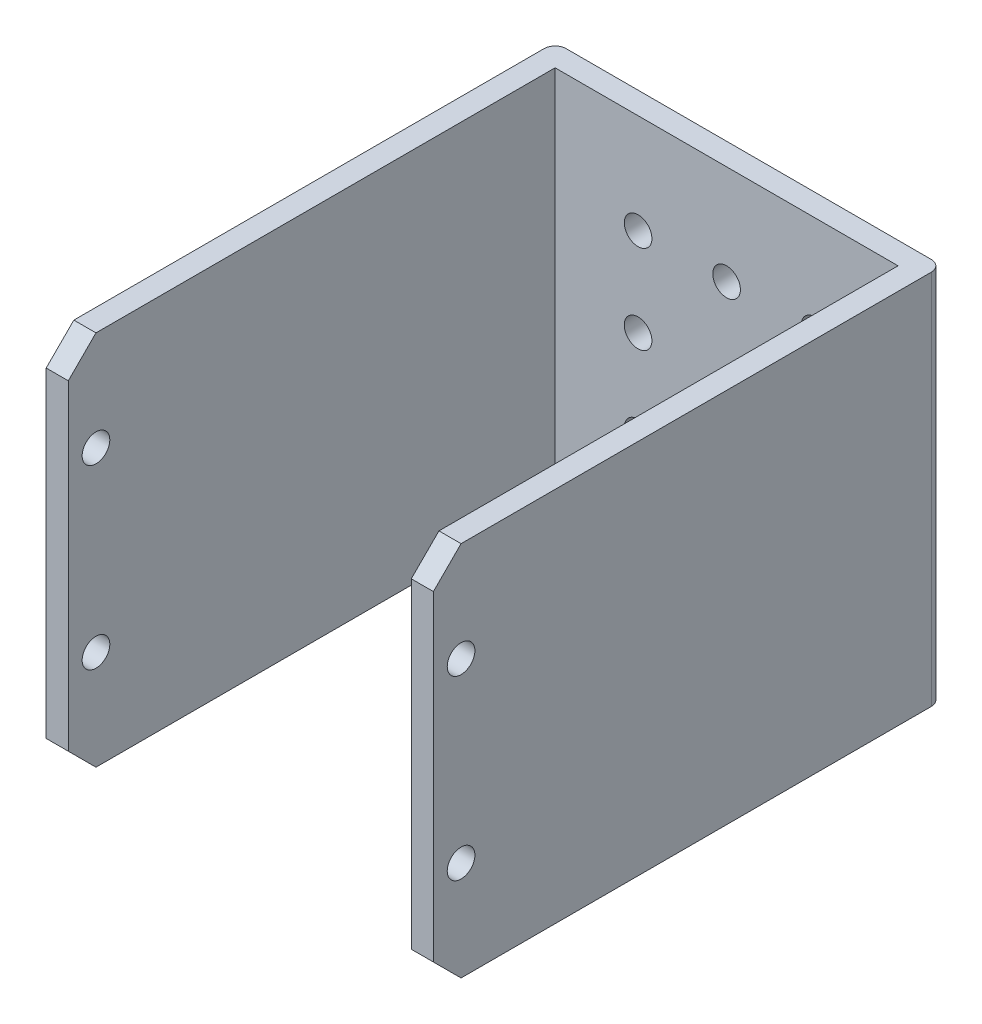
ISO-10303-21;
HEADER;
FILE_DESCRIPTION(('STEP AP214'),'2;1');
FILE_NAME('part.step','',(''),(''),'','','');
FILE_SCHEMA(('AUTOMOTIVE_DESIGN { 1 0 10303 214 1 1 1 1 }'));
ENDSEC;
DATA;
#1=APPLICATION_CONTEXT('core data for automotive mechanical design processes');
#2=APPLICATION_PROTOCOL_DEFINITION('international standard','automotive_design',2000,#1);
#3=PRODUCT_CONTEXT('',#1,'mechanical');
#4=PRODUCT('Part','Part','',(#3));
#5=PRODUCT_RELATED_PRODUCT_CATEGORY('part','',(#4));
#6=PRODUCT_DEFINITION_FORMATION('','',#4);
#7=PRODUCT_DEFINITION_CONTEXT('part definition',#1,'design');
#8=PRODUCT_DEFINITION('design','',#6,#7);
#9=PRODUCT_DEFINITION_SHAPE('','',#8);
#10=(LENGTH_UNIT() NAMED_UNIT(*) SI_UNIT(.MILLI.,.METRE.));
#11=(NAMED_UNIT(*) PLANE_ANGLE_UNIT() SI_UNIT($,.RADIAN.));
#12=(NAMED_UNIT(*) SI_UNIT($,.STERADIAN.) SOLID_ANGLE_UNIT());
#13=UNCERTAINTY_MEASURE_WITH_UNIT(LENGTH_MEASURE(1.E-05),#10,'distance_accuracy_value','');
#14=(GEOMETRIC_REPRESENTATION_CONTEXT(3) GLOBAL_UNCERTAINTY_ASSIGNED_CONTEXT((#13)) GLOBAL_UNIT_ASSIGNED_CONTEXT((#10,
#11,#12)) REPRESENTATION_CONTEXT('',''));
#15=CARTESIAN_POINT('',(0.,0.,0.));
#16=DIRECTION('',(0.,0.,1.));
#17=DIRECTION('',(1.,0.,0.));
#18=AXIS2_PLACEMENT_3D('',#15,#16,#17);
#19=CARTESIAN_POINT('',(0.,0.,46.));
#20=DIRECTION('',(0.,0.,1.));
#21=DIRECTION('',(1.,0.,0.));
#22=AXIS2_PLACEMENT_3D('',#19,#20,#21);
#23=PLANE('',#22);
#24=DIRECTION('',(0.,-1.,0.));
#25=VECTOR('',#24,1.);
#26=CARTESIAN_POINT('',(0.,0.,46.));
#27=LINE('',#26,#25);
#28=CARTESIAN_POINT('',(0.,31.5,46.));
#29=VERTEX_POINT('',#28);
#30=CARTESIAN_POINT('',(0.,2.50000000000001,46.));
#31=VERTEX_POINT('',#30);
#32=EDGE_CURVE('E182',#29,#31,#27,.T.);
#33=ORIENTED_EDGE('',*,*,#32,.T.);
#34=DIRECTION('',(1.,0.,0.));
#35=VECTOR('',#34,1.);
#36=CARTESIAN_POINT('',(2.,2.50000000000001,46.));
#37=LINE('',#36,#35);
#38=CARTESIAN_POINT('',(2.,2.50000000000001,46.));
#39=VERTEX_POINT('',#38);
#40=EDGE_CURVE('E239',#31,#39,#37,.T.);
#41=ORIENTED_EDGE('',*,*,#40,.T.);
#42=DIRECTION('',(0.,-1.,0.));
#43=VECTOR('',#42,1.);
#44=CARTESIAN_POINT('',(1.99999999999999,34.,46.));
#45=LINE('',#44,#43);
#46=CARTESIAN_POINT('',(1.99999999999999,31.5,46.));
#47=VERTEX_POINT('',#46);
#48=EDGE_CURVE('E167',#47,#39,#45,.T.);
#49=ORIENTED_EDGE('',*,*,#48,.F.);
#50=DIRECTION('',(-1.,0.,0.));
#51=VECTOR('',#50,1.);
#52=CARTESIAN_POINT('',(0.,31.5,46.));
#53=LINE('',#52,#51);
#54=EDGE_CURVE('E236',#47,#29,#53,.T.);
#55=ORIENTED_EDGE('',*,*,#54,.T.);
#56=EDGE_LOOP('',(#33,#41,#49,#55));
#57=FACE_BOUND('',#56,.T.);
#58=ADVANCED_FACE('F35',(#57),#23,.T.);
#59=CARTESIAN_POINT('',(35.,0.,46.));
#60=DIRECTION('',(-1.,0.,0.));
#61=DIRECTION('',(0.,0.,1.));
#62=AXIS2_PLACEMENT_3D('',#59,#60,#61);
#63=PLANE('',#62);
#64=CARTESIAN_POINT('',(35.,25.,43.5));
#65=DIRECTION('',(-1.,0.,0.));
#66=DIRECTION('',(0.,0.,1.));
#67=AXIS2_PLACEMENT_3D('',#64,#65,#66);
#68=CIRCLE('',#67,1.25);
#69=CARTESIAN_POINT('',(35.,25.,44.75));
#70=VERTEX_POINT('',#69);
#71=EDGE_CURVE('E169',#70,#70,#68,.T.);
#72=ORIENTED_EDGE('',*,*,#71,.T.);
#73=EDGE_LOOP('',(#72));
#74=FACE_BOUND('',#73,.T.);
#75=CARTESIAN_POINT('',(35.,8.99999999999999,43.5000000000002));
#76=DIRECTION('',(-1.,0.,0.));
#77=DIRECTION('',(0.,0.,1.));
#78=AXIS2_PLACEMENT_3D('',#75,#76,#77);
#79=CIRCLE('',#78,1.25000000000001);
#80=CARTESIAN_POINT('',(35.,8.99999999999999,44.7500000000002));
#81=VERTEX_POINT('',#80);
#82=EDGE_CURVE('E255',#81,#81,#79,.T.);
#83=ORIENTED_EDGE('',*,*,#82,.T.);
#84=EDGE_LOOP('',(#83));
#85=FACE_BOUND('',#84,.T.);
#86=DIRECTION('',(0.,1.,0.));
#87=VECTOR('',#86,1.);
#88=CARTESIAN_POINT('',(35.,0.,46.));
#89=LINE('',#88,#87);
#90=CARTESIAN_POINT('',(35.,2.50000000000001,46.));
#91=VERTEX_POINT('',#90);
#92=CARTESIAN_POINT('',(35.,31.5,46.));
#93=VERTEX_POINT('',#92);
#94=EDGE_CURVE('E179',#91,#93,#89,.T.);
#95=ORIENTED_EDGE('',*,*,#94,.F.);
#96=DIRECTION('',(0.,-0.707106781186548,-0.707106781186548));
#97=VECTOR('',#96,1.);
#98=CARTESIAN_POINT('',(35.,2.50000000000001,46.));
#99=LINE('',#98,#97);
#100=CARTESIAN_POINT('',(35.,0.,43.5));
#101=VERTEX_POINT('',#100);
#102=EDGE_CURVE('E226',#91,#101,#99,.T.);
#103=ORIENTED_EDGE('',*,*,#102,.T.);
#104=DIRECTION('',(0.,0.,-1.));
#105=VECTOR('',#104,1.);
#106=CARTESIAN_POINT('',(35.,0.,46.));
#107=LINE('',#106,#105);
#108=CARTESIAN_POINT('',(35.,0.,1.));
#109=VERTEX_POINT('',#108);
#110=EDGE_CURVE('E186',#101,#109,#107,.T.);
#111=ORIENTED_EDGE('',*,*,#110,.T.);
#112=DIRECTION('',(0.,1.,0.));
#113=VECTOR('',#112,1.);
#114=CARTESIAN_POINT('',(35.,0.,1.));
#115=LINE('',#114,#113);
#116=CARTESIAN_POINT('',(35.,34.,1.));
#117=VERTEX_POINT('',#116);
#118=EDGE_CURVE('E198',#109,#117,#115,.T.);
#119=ORIENTED_EDGE('',*,*,#118,.T.);
#120=DIRECTION('',(0.,0.,-1.));
#121=VECTOR('',#120,1.);
#122=CARTESIAN_POINT('',(35.,34.,46.));
#123=LINE('',#122,#121);
#124=CARTESIAN_POINT('',(35.,34.,43.5));
#125=VERTEX_POINT('',#124);
#126=EDGE_CURVE('E196',#125,#117,#123,.T.);
#127=ORIENTED_EDGE('',*,*,#126,.F.);
#128=DIRECTION('',(0.,-0.707106781186548,0.707106781186548));
#129=VECTOR('',#128,1.);
#130=CARTESIAN_POINT('',(35.,31.5,46.));
#131=LINE('',#130,#129);
#132=EDGE_CURVE('E224',#125,#93,#131,.T.);
#133=ORIENTED_EDGE('',*,*,#132,.T.);
#134=EDGE_LOOP('',(#95,#103,#111,#119,#127,#133));
#135=FACE_BOUND('',#134,.T.);
#136=ADVANCED_FACE('F275',(#74,#85,#135),#63,.F.);
#137=CARTESIAN_POINT('',(35.,34.,46.));
#138=DIRECTION('',(0.,-1.,0.));
#139=DIRECTION('',(1.,0.,0.));
#140=AXIS2_PLACEMENT_3D('',#137,#138,#139);
#141=PLANE('',#140);
#142=DIRECTION('',(0.,0.,1.));
#143=VECTOR('',#142,1.);
#144=CARTESIAN_POINT('',(33.,34.,2.));
#145=LINE('',#144,#143);
#146=CARTESIAN_POINT('',(33.,34.,2.));
#147=VERTEX_POINT('',#146);
#148=CARTESIAN_POINT('',(33.,34.,43.5));
#149=VERTEX_POINT('',#148);
#150=EDGE_CURVE('E175',#147,#149,#145,.T.);
#151=ORIENTED_EDGE('',*,*,#150,.T.);
#152=DIRECTION('',(1.,0.,0.));
#153=VECTOR('',#152,1.);
#154=CARTESIAN_POINT('',(35.,34.,43.5));
#155=LINE('',#154,#153);
#156=EDGE_CURVE('E11',#149,#125,#155,.T.);
#157=ORIENTED_EDGE('',*,*,#156,.T.);
#158=ORIENTED_EDGE('',*,*,#126,.T.);
#159=CARTESIAN_POINT('',(34.,34.,1.));
#160=DIRECTION('',(0.,-1.,0.));
#161=DIRECTION('',(1.,0.,0.));
#162=AXIS2_PLACEMENT_3D('',#159,#160,#161);
#163=CIRCLE('',#162,1.);
#164=CARTESIAN_POINT('',(34.,34.,0.));
#165=VERTEX_POINT('',#164);
#166=EDGE_CURVE('E204',#117,#165,#163,.F.);
#167=ORIENTED_EDGE('',*,*,#166,.T.);
#168=DIRECTION('',(-1.,0.,0.));
#169=VECTOR('',#168,1.);
#170=CARTESIAN_POINT('',(35.,34.,0.));
#171=LINE('',#170,#169);
#172=CARTESIAN_POINT('',(1.,34.,0.));
#173=VERTEX_POINT('',#172);
#174=EDGE_CURVE('E174',#165,#173,#171,.T.);
#175=ORIENTED_EDGE('',*,*,#174,.T.);
#176=CARTESIAN_POINT('',(1.,34.,1.));
#177=DIRECTION('',(0.,-1.,0.));
#178=DIRECTION('',(1.,0.,0.));
#179=AXIS2_PLACEMENT_3D('',#176,#177,#178);
#180=CIRCLE('',#179,1.);
#181=CARTESIAN_POINT('',(0.,34.,1.));
#182=VERTEX_POINT('',#181);
#183=EDGE_CURVE('E201',#173,#182,#180,.F.);
#184=ORIENTED_EDGE('',*,*,#183,.T.);
#185=DIRECTION('',(0.,0.,-1.));
#186=VECTOR('',#185,1.);
#187=CARTESIAN_POINT('',(0.,34.,46.));
#188=LINE('',#187,#186);
#189=CARTESIAN_POINT('',(0.,34.,43.5));
#190=VERTEX_POINT('',#189);
#191=EDGE_CURVE('E194',#190,#182,#188,.T.);
#192=ORIENTED_EDGE('',*,*,#191,.F.);
#193=DIRECTION('',(1.,0.,0.));
#194=VECTOR('',#193,1.);
#195=CARTESIAN_POINT('',(1.99999999999999,34.,43.5));
#196=LINE('',#195,#194);
#197=CARTESIAN_POINT('',(1.99999999999999,34.,43.5));
#198=VERTEX_POINT('',#197);
#199=EDGE_CURVE('E44',#190,#198,#196,.T.);
#200=ORIENTED_EDGE('',*,*,#199,.T.);
#201=DIRECTION('',(0.,0.,1.));
#202=VECTOR('',#201,1.);
#203=CARTESIAN_POINT('',(1.99999999999999,34.,2.));
#204=LINE('',#203,#202);
#205=CARTESIAN_POINT('',(1.99999999999999,34.,2.));
#206=VERTEX_POINT('',#205);
#207=EDGE_CURVE('E172',#206,#198,#204,.T.);
#208=ORIENTED_EDGE('',*,*,#207,.F.);
#209=DIRECTION('',(-1.,0.,0.));
#210=VECTOR('',#209,1.);
#211=CARTESIAN_POINT('',(1.99999999999999,34.,2.));
#212=LINE('',#211,#210);
#213=EDGE_CURVE('E147',#147,#206,#212,.T.);
#214=ORIENTED_EDGE('',*,*,#213,.F.);
#215=EDGE_LOOP('',(#151,#157,#158,#167,#175,#184,#192,#200,#208,#214));
#216=FACE_BOUND('',#215,.T.);
#217=ADVANCED_FACE('F303',(#216),#141,.F.);
#218=CARTESIAN_POINT('',(0.,0.,46.));
#219=DIRECTION('',(1.,0.,0.));
#220=DIRECTION('',(0.,1.,0.));
#221=AXIS2_PLACEMENT_3D('',#218,#219,#220);
#222=PLANE('',#221);
#223=CARTESIAN_POINT('',(0.,25.,43.5));
#224=DIRECTION('',(-1.,0.,0.));
#225=DIRECTION('',(0.,-1.,0.));
#226=AXIS2_PLACEMENT_3D('',#223,#224,#225);
#227=CIRCLE('',#226,1.25);
#228=CARTESIAN_POINT('',(0.,23.75,43.5));
#229=VERTEX_POINT('',#228);
#230=EDGE_CURVE('E251',#229,#229,#227,.T.);
#231=ORIENTED_EDGE('',*,*,#230,.F.);
#232=EDGE_LOOP('',(#231));
#233=FACE_BOUND('',#232,.T.);
#234=CARTESIAN_POINT('',(0.,8.99999999999999,43.5000000000002));
#235=DIRECTION('',(-1.,0.,0.));
#236=DIRECTION('',(0.,-1.,0.));
#237=AXIS2_PLACEMENT_3D('',#234,#235,#236);
#238=CIRCLE('',#237,1.25000000000001);
#239=CARTESIAN_POINT('',(0.,7.74999999999999,43.5000000000002));
#240=VERTEX_POINT('',#239);
#241=EDGE_CURVE('E258',#240,#240,#238,.T.);
#242=ORIENTED_EDGE('',*,*,#241,.F.);
#243=EDGE_LOOP('',(#242));
#244=FACE_BOUND('',#243,.T.);
#245=DIRECTION('',(0.,0.,-1.));
#246=VECTOR('',#245,1.);
#247=CARTESIAN_POINT('',(0.,0.,46.));
#248=LINE('',#247,#246);
#249=CARTESIAN_POINT('',(0.,0.,43.5));
#250=VERTEX_POINT('',#249);
#251=CARTESIAN_POINT('',(0.,0.,1.));
#252=VERTEX_POINT('',#251);
#253=EDGE_CURVE('E192',#250,#252,#248,.T.);
#254=ORIENTED_EDGE('',*,*,#253,.F.);
#255=DIRECTION('',(0.,0.707106781186548,0.707106781186548));
#256=VECTOR('',#255,1.);
#257=CARTESIAN_POINT('',(0.,2.50000000000001,46.));
#258=LINE('',#257,#256);
#259=EDGE_CURVE('E246',#250,#31,#258,.T.);
#260=ORIENTED_EDGE('',*,*,#259,.T.);
#261=ORIENTED_EDGE('',*,*,#32,.F.);
#262=DIRECTION('',(0.,0.707106781186548,-0.707106781186548));
#263=VECTOR('',#262,1.);
#264=CARTESIAN_POINT('',(0.,31.5,46.));
#265=LINE('',#264,#263);
#266=EDGE_CURVE('E52',#29,#190,#265,.T.);
#267=ORIENTED_EDGE('',*,*,#266,.T.);
#268=ORIENTED_EDGE('',*,*,#191,.T.);
#269=DIRECTION('',(0.,-1.,0.));
#270=VECTOR('',#269,1.);
#271=CARTESIAN_POINT('',(0.,0.,1.));
#272=LINE('',#271,#270);
#273=EDGE_CURVE('E215',#182,#252,#272,.T.);
#274=ORIENTED_EDGE('',*,*,#273,.T.);
#275=EDGE_LOOP('',(#254,#260,#261,#267,#268,#274));
#276=FACE_BOUND('',#275,.T.);
#277=ADVANCED_FACE('F315',(#233,#244,#276),#222,.F.);
#278=CARTESIAN_POINT('',(35.,0.,46.));
#279=DIRECTION('',(0.,1.,0.));
#280=DIRECTION('',(-1.,0.,0.));
#281=AXIS2_PLACEMENT_3D('',#278,#279,#280);
#282=PLANE('',#281);
#283=ORIENTED_EDGE('',*,*,#110,.F.);
#284=DIRECTION('',(-1.,0.,0.));
#285=VECTOR('',#284,1.);
#286=CARTESIAN_POINT('',(33.,0.,43.5));
#287=LINE('',#286,#285);
#288=CARTESIAN_POINT('',(33.,0.,43.5));
#289=VERTEX_POINT('',#288);
#290=EDGE_CURVE('E230',#101,#289,#287,.T.);
#291=ORIENTED_EDGE('',*,*,#290,.T.);
#292=DIRECTION('',(0.,0.,1.));
#293=VECTOR('',#292,1.);
#294=CARTESIAN_POINT('',(33.,0.,2.));
#295=LINE('',#294,#293);
#296=CARTESIAN_POINT('',(33.,0.,2.));
#297=VERTEX_POINT('',#296);
#298=EDGE_CURVE('E146',#297,#289,#295,.T.);
#299=ORIENTED_EDGE('',*,*,#298,.F.);
#300=DIRECTION('',(1.,0.,0.));
#301=VECTOR('',#300,1.);
#302=CARTESIAN_POINT('',(2.,0.,2.));
#303=LINE('',#302,#301);
#304=CARTESIAN_POINT('',(2.,0.,2.));
#305=VERTEX_POINT('',#304);
#306=EDGE_CURVE('E153',#305,#297,#303,.T.);
#307=ORIENTED_EDGE('',*,*,#306,.F.);
#308=DIRECTION('',(0.,0.,1.));
#309=VECTOR('',#308,1.);
#310=CARTESIAN_POINT('',(2.,0.,2.));
#311=LINE('',#310,#309);
#312=CARTESIAN_POINT('',(2.,0.,43.5));
#313=VERTEX_POINT('',#312);
#314=EDGE_CURVE('E136',#305,#313,#311,.T.);
#315=ORIENTED_EDGE('',*,*,#314,.T.);
#316=DIRECTION('',(-1.,0.,0.));
#317=VECTOR('',#316,1.);
#318=CARTESIAN_POINT('',(0.,0.,43.5));
#319=LINE('',#318,#317);
#320=EDGE_CURVE('E228',#313,#250,#319,.T.);
#321=ORIENTED_EDGE('',*,*,#320,.T.);
#322=ORIENTED_EDGE('',*,*,#253,.T.);
#323=CARTESIAN_POINT('',(1.,0.,1.));
#324=DIRECTION('',(0.,1.,0.));
#325=DIRECTION('',(-1.,0.,0.));
#326=AXIS2_PLACEMENT_3D('',#323,#324,#325);
#327=CIRCLE('',#326,1.);
#328=CARTESIAN_POINT('',(1.,0.,0.));
#329=VERTEX_POINT('',#328);
#330=EDGE_CURVE('E210',#252,#329,#327,.F.);
#331=ORIENTED_EDGE('',*,*,#330,.T.);
#332=DIRECTION('',(1.,0.,0.));
#333=VECTOR('',#332,1.);
#334=CARTESIAN_POINT('',(35.,0.,0.));
#335=LINE('',#334,#333);
#336=CARTESIAN_POINT('',(34.,0.,0.));
#337=VERTEX_POINT('',#336);
#338=EDGE_CURVE('E183',#329,#337,#335,.T.);
#339=ORIENTED_EDGE('',*,*,#338,.T.);
#340=CARTESIAN_POINT('',(34.,0.,1.));
#341=DIRECTION('',(0.,1.,0.));
#342=DIRECTION('',(-1.,0.,0.));
#343=AXIS2_PLACEMENT_3D('',#340,#341,#342);
#344=CIRCLE('',#343,1.);
#345=EDGE_CURVE('E212',#337,#109,#344,.F.);
#346=ORIENTED_EDGE('',*,*,#345,.T.);
#347=EDGE_LOOP('',(#283,#291,#299,#307,#315,#321,#322,#331,#339,#346));
#348=FACE_BOUND('',#347,.T.);
#349=ADVANCED_FACE('F159',(#348),#282,.F.);
#350=DIRECTION('',(0.,1.,0.));
#351=VECTOR('',#350,1.);
#352=CARTESIAN_POINT('',(33.,34.,46.));
#353=LINE('',#352,#351);
#354=CARTESIAN_POINT('',(33.,2.50000000000001,46.));
#355=VERTEX_POINT('',#354);
#356=CARTESIAN_POINT('',(33.,31.5,46.));
#357=VERTEX_POINT('',#356);
#358=EDGE_CURVE('E156',#355,#357,#353,.T.);
#359=ORIENTED_EDGE('',*,*,#358,.F.);
#360=DIRECTION('',(1.,0.,0.));
#361=VECTOR('',#360,1.);
#362=CARTESIAN_POINT('',(35.,2.50000000000001,46.));
#363=LINE('',#362,#361);
#364=EDGE_CURVE('E221',#355,#91,#363,.T.);
#365=ORIENTED_EDGE('',*,*,#364,.T.);
#366=ORIENTED_EDGE('',*,*,#94,.T.);
#367=DIRECTION('',(-1.,0.,0.));
#368=VECTOR('',#367,1.);
#369=CARTESIAN_POINT('',(33.,31.5,46.));
#370=LINE('',#369,#368);
#371=EDGE_CURVE('E218',#93,#357,#370,.T.);
#372=ORIENTED_EDGE('',*,*,#371,.T.);
#373=EDGE_LOOP('',(#359,#365,#366,#372));
#374=FACE_BOUND('',#373,.T.);
#375=ADVANCED_FACE('F299',(#374),#23,.T.);
#376=CARTESIAN_POINT('',(0.,0.,0.));
#377=DIRECTION('',(0.,0.,1.));
#378=DIRECTION('',(1.,0.,0.));
#379=AXIS2_PLACEMENT_3D('',#376,#377,#378);
#380=PLANE('',#379);
#381=CARTESIAN_POINT('',(9.49999999999999,25.,0.));
#382=DIRECTION('',(0.,0.,1.));
#383=DIRECTION('',(1.,0.,0.));
#384=AXIS2_PLACEMENT_3D('',#381,#382,#383);
#385=CIRCLE('',#384,1.25);
#386=CARTESIAN_POINT('',(10.75,25.,0.));
#387=VERTEX_POINT('',#386);
#388=EDGE_CURVE('E263',#387,#387,#385,.T.);
#389=ORIENTED_EDGE('',*,*,#388,.T.);
#390=EDGE_LOOP('',(#389));
#391=FACE_BOUND('',#390,.T.);
#392=CARTESIAN_POINT('',(9.49999999999999,17.,0.));
#393=DIRECTION('',(0.,0.,1.));
#394=DIRECTION('',(1.,0.,0.));
#395=AXIS2_PLACEMENT_3D('',#392,#393,#394);
#396=CIRCLE('',#395,1.25);
#397=CARTESIAN_POINT('',(10.75,17.,0.));
#398=VERTEX_POINT('',#397);
#399=EDGE_CURVE('E506',#398,#398,#396,.T.);
#400=ORIENTED_EDGE('',*,*,#399,.T.);
#401=EDGE_LOOP('',(#400));
#402=FACE_BOUND('',#401,.T.);
#403=CARTESIAN_POINT('',(9.49999999999999,9.,0.));
#404=DIRECTION('',(0.,0.,1.));
#405=DIRECTION('',(1.,0.,0.));
#406=AXIS2_PLACEMENT_3D('',#403,#404,#405);
#407=CIRCLE('',#406,1.25);
#408=CARTESIAN_POINT('',(10.75,9.,0.));
#409=VERTEX_POINT('',#408);
#410=EDGE_CURVE('E508',#409,#409,#407,.T.);
#411=ORIENTED_EDGE('',*,*,#410,.T.);
#412=EDGE_LOOP('',(#411));
#413=FACE_BOUND('',#412,.T.);
#414=CARTESIAN_POINT('',(25.5,25.0000000000002,0.));
#415=DIRECTION('',(0.,0.,1.));
#416=DIRECTION('',(1.,0.,0.));
#417=AXIS2_PLACEMENT_3D('',#414,#415,#416);
#418=CIRCLE('',#417,1.25);
#419=CARTESIAN_POINT('',(26.75,25.0000000000002,0.));
#420=VERTEX_POINT('',#419);
#421=EDGE_CURVE('E512',#420,#420,#418,.T.);
#422=ORIENTED_EDGE('',*,*,#421,.T.);
#423=EDGE_LOOP('',(#422));
#424=FACE_BOUND('',#423,.T.);
#425=CARTESIAN_POINT('',(17.5,25.0000000000001,0.));
#426=DIRECTION('',(0.,0.,1.));
#427=DIRECTION('',(1.,0.,0.));
#428=AXIS2_PLACEMENT_3D('',#425,#426,#427);
#429=CIRCLE('',#428,1.25);
#430=CARTESIAN_POINT('',(18.75,25.0000000000001,0.));
#431=VERTEX_POINT('',#430);
#432=EDGE_CURVE('E517',#431,#431,#429,.T.);
#433=ORIENTED_EDGE('',*,*,#432,.T.);
#434=EDGE_LOOP('',(#433));
#435=FACE_BOUND('',#434,.T.);
#436=CARTESIAN_POINT('',(25.5,17.0000000000002,0.));
#437=DIRECTION('',(0.,0.,1.));
#438=DIRECTION('',(1.,0.,0.));
#439=AXIS2_PLACEMENT_3D('',#436,#437,#438);
#440=CIRCLE('',#439,1.25);
#441=CARTESIAN_POINT('',(26.75,17.0000000000002,0.));
#442=VERTEX_POINT('',#441);
#443=EDGE_CURVE('E520',#442,#442,#440,.T.);
#444=ORIENTED_EDGE('',*,*,#443,.T.);
#445=EDGE_LOOP('',(#444));
#446=FACE_BOUND('',#445,.T.);
#447=CARTESIAN_POINT('',(25.5,9.00000000000022,0.));
#448=DIRECTION('',(0.,0.,1.));
#449=DIRECTION('',(1.,0.,0.));
#450=AXIS2_PLACEMENT_3D('',#447,#448,#449);
#451=CIRCLE('',#450,1.25);
#452=CARTESIAN_POINT('',(26.75,9.00000000000022,0.));
#453=VERTEX_POINT('',#452);
#454=EDGE_CURVE('E523',#453,#453,#451,.T.);
#455=ORIENTED_EDGE('',*,*,#454,.T.);
#456=EDGE_LOOP('',(#455));
#457=FACE_BOUND('',#456,.T.);
#458=CARTESIAN_POINT('',(17.5,9.00000000000011,0.));
#459=DIRECTION('',(0.,0.,1.));
#460=DIRECTION('',(1.,0.,0.));
#461=AXIS2_PLACEMENT_3D('',#458,#459,#460);
#462=CIRCLE('',#461,1.25);
#463=CARTESIAN_POINT('',(18.75,9.00000000000011,0.));
#464=VERTEX_POINT('',#463);
#465=EDGE_CURVE('E526',#464,#464,#462,.T.);
#466=ORIENTED_EDGE('',*,*,#465,.T.);
#467=EDGE_LOOP('',(#466));
#468=FACE_BOUND('',#467,.T.);
#469=ORIENTED_EDGE('',*,*,#174,.F.);
#470=DIRECTION('',(0.,1.,0.));
#471=VECTOR('',#470,1.);
#472=CARTESIAN_POINT('',(34.,0.,0.));
#473=LINE('',#472,#471);
#474=EDGE_CURVE('E208',#165,#337,#473,.F.);
#475=ORIENTED_EDGE('',*,*,#474,.T.);
#476=ORIENTED_EDGE('',*,*,#338,.F.);
#477=DIRECTION('',(0.,-1.,0.));
#478=VECTOR('',#477,1.);
#479=CARTESIAN_POINT('',(1.,0.,0.));
#480=LINE('',#479,#478);
#481=EDGE_CURVE('E206',#329,#173,#480,.F.);
#482=ORIENTED_EDGE('',*,*,#481,.T.);
#483=EDGE_LOOP('',(#469,#475,#476,#482));
#484=FACE_BOUND('',#483,.T.);
#485=ADVANCED_FACE('F308',(#391,#402,#413,#424,#435,#446,#457,#468,#484),#380,.F.);
#486=CARTESIAN_POINT('',(1.99999999999999,34.,2.));
#487=DIRECTION('',(-1.,0.,0.));
#488=DIRECTION('',(0.,-1.,0.));
#489=AXIS2_PLACEMENT_3D('',#486,#487,#488);
#490=PLANE('',#489);
#491=CARTESIAN_POINT('',(1.99999999999999,25.,43.5));
#492=DIRECTION('',(-1.,0.,0.));
#493=DIRECTION('',(0.,-1.,0.));
#494=AXIS2_PLACEMENT_3D('',#491,#492,#493);
#495=CIRCLE('',#494,1.25);
#496=CARTESIAN_POINT('',(2.,23.75,43.5));
#497=VERTEX_POINT('',#496);
#498=EDGE_CURVE('E270',#497,#497,#495,.T.);
#499=ORIENTED_EDGE('',*,*,#498,.T.);
#500=EDGE_LOOP('',(#499));
#501=FACE_BOUND('',#500,.T.);
#502=CARTESIAN_POINT('',(2.,8.99999999999999,43.5000000000002));
#503=DIRECTION('',(-1.,0.,0.));
#504=DIRECTION('',(0.,-1.,0.));
#505=AXIS2_PLACEMENT_3D('',#502,#503,#504);
#506=CIRCLE('',#505,1.25000000000001);
#507=CARTESIAN_POINT('',(2.,7.74999999999999,43.5000000000002));
#508=VERTEX_POINT('',#507);
#509=EDGE_CURVE('E250',#508,#508,#506,.T.);
#510=ORIENTED_EDGE('',*,*,#509,.T.);
#511=EDGE_LOOP('',(#510));
#512=FACE_BOUND('',#511,.T.);
#513=ORIENTED_EDGE('',*,*,#48,.T.);
#514=DIRECTION('',(0.,-0.707106781186548,-0.707106781186548));
#515=VECTOR('',#514,1.);
#516=CARTESIAN_POINT('',(2.,2.50000000000001,46.));
#517=LINE('',#516,#515);
#518=EDGE_CURVE('E142',#39,#313,#517,.T.);
#519=ORIENTED_EDGE('',*,*,#518,.T.);
#520=ORIENTED_EDGE('',*,*,#314,.F.);
#521=DIRECTION('',(0.,-1.,0.));
#522=VECTOR('',#521,1.);
#523=CARTESIAN_POINT('',(1.99999999999999,34.,2.));
#524=LINE('',#523,#522);
#525=EDGE_CURVE('E140',#206,#305,#524,.T.);
#526=ORIENTED_EDGE('',*,*,#525,.F.);
#527=ORIENTED_EDGE('',*,*,#207,.T.);
#528=DIRECTION('',(0.,-0.707106781186548,0.707106781186548));
#529=VECTOR('',#528,1.);
#530=CARTESIAN_POINT('',(1.99999999999999,31.5,46.));
#531=LINE('',#530,#529);
#532=EDGE_CURVE('E242',#198,#47,#531,.T.);
#533=ORIENTED_EDGE('',*,*,#532,.T.);
#534=EDGE_LOOP('',(#513,#519,#520,#526,#527,#533));
#535=FACE_BOUND('',#534,.T.);
#536=ADVANCED_FACE('F139',(#501,#512,#535),#490,.F.);
#537=CARTESIAN_POINT('',(33.,34.,2.));
#538=DIRECTION('',(1.,0.,0.));
#539=DIRECTION('',(0.,0.,-1.));
#540=AXIS2_PLACEMENT_3D('',#537,#538,#539);
#541=PLANE('',#540);
#542=CARTESIAN_POINT('',(33.,25.,43.5));
#543=DIRECTION('',(1.,0.,0.));
#544=DIRECTION('',(0.,0.,-1.));
#545=AXIS2_PLACEMENT_3D('',#542,#543,#544);
#546=CIRCLE('',#545,1.25);
#547=CARTESIAN_POINT('',(33.,25.,42.25));
#548=VERTEX_POINT('',#547);
#549=EDGE_CURVE('E39',#548,#548,#546,.T.);
#550=ORIENTED_EDGE('',*,*,#549,.T.);
#551=EDGE_LOOP('',(#550));
#552=FACE_BOUND('',#551,.T.);
#553=CARTESIAN_POINT('',(33.,8.99999999999999,43.5000000000002));
#554=DIRECTION('',(1.,0.,0.));
#555=DIRECTION('',(0.,0.,-1.));
#556=AXIS2_PLACEMENT_3D('',#553,#554,#555);
#557=CIRCLE('',#556,1.25000000000001);
#558=CARTESIAN_POINT('',(33.,8.99999999999999,42.2500000000002));
#559=VERTEX_POINT('',#558);
#560=EDGE_CURVE('E248',#559,#559,#557,.T.);
#561=ORIENTED_EDGE('',*,*,#560,.T.);
#562=EDGE_LOOP('',(#561));
#563=FACE_BOUND('',#562,.T.);
#564=ORIENTED_EDGE('',*,*,#298,.T.);
#565=DIRECTION('',(0.,0.707106781186548,0.707106781186548));
#566=VECTOR('',#565,1.);
#567=CARTESIAN_POINT('',(33.,2.50000000000001,46.));
#568=LINE('',#567,#566);
#569=EDGE_CURVE('E234',#289,#355,#568,.T.);
#570=ORIENTED_EDGE('',*,*,#569,.T.);
#571=ORIENTED_EDGE('',*,*,#358,.T.);
#572=DIRECTION('',(0.,0.707106781186548,-0.707106781186548));
#573=VECTOR('',#572,1.);
#574=CARTESIAN_POINT('',(33.,31.5,46.));
#575=LINE('',#574,#573);
#576=EDGE_CURVE('E232',#357,#149,#575,.T.);
#577=ORIENTED_EDGE('',*,*,#576,.T.);
#578=ORIENTED_EDGE('',*,*,#150,.F.);
#579=DIRECTION('',(0.,1.,0.));
#580=VECTOR('',#579,1.);
#581=CARTESIAN_POINT('',(33.,34.,2.));
#582=LINE('',#581,#580);
#583=EDGE_CURVE('E161',#297,#147,#582,.T.);
#584=ORIENTED_EDGE('',*,*,#583,.F.);
#585=EDGE_LOOP('',(#564,#570,#571,#577,#578,#584));
#586=FACE_BOUND('',#585,.T.);
#587=ADVANCED_FACE('F339',(#552,#563,#586),#541,.F.);
#588=CARTESIAN_POINT('',(0.,0.,2.));
#589=DIRECTION('',(0.,0.,1.));
#590=DIRECTION('',(1.,0.,0.));
#591=AXIS2_PLACEMENT_3D('',#588,#589,#590);
#592=PLANE('',#591);
#593=CARTESIAN_POINT('',(9.49999999999999,25.,2.));
#594=DIRECTION('',(0.,0.,1.));
#595=DIRECTION('',(1.,0.,0.));
#596=AXIS2_PLACEMENT_3D('',#593,#594,#595);
#597=CIRCLE('',#596,1.25);
#598=CARTESIAN_POINT('',(10.75,25.,2.));
#599=VERTEX_POINT('',#598);
#600=EDGE_CURVE('E503',#599,#599,#597,.T.);
#601=ORIENTED_EDGE('',*,*,#600,.F.);
#602=EDGE_LOOP('',(#601));
#603=FACE_BOUND('',#602,.T.);
#604=CARTESIAN_POINT('',(9.49999999999999,17.,2.));
#605=DIRECTION('',(0.,0.,1.));
#606=DIRECTION('',(1.,0.,0.));
#607=AXIS2_PLACEMENT_3D('',#604,#605,#606);
#608=CIRCLE('',#607,1.25);
#609=CARTESIAN_POINT('',(10.75,17.,2.));
#610=VERTEX_POINT('',#609);
#611=EDGE_CURVE('E534',#610,#610,#608,.T.);
#612=ORIENTED_EDGE('',*,*,#611,.F.);
#613=EDGE_LOOP('',(#612));
#614=FACE_BOUND('',#613,.T.);
#615=CARTESIAN_POINT('',(9.49999999999999,9.,2.));
#616=DIRECTION('',(0.,0.,1.));
#617=DIRECTION('',(1.,0.,0.));
#618=AXIS2_PLACEMENT_3D('',#615,#616,#617);
#619=CIRCLE('',#618,1.25);
#620=CARTESIAN_POINT('',(10.75,9.,2.));
#621=VERTEX_POINT('',#620);
#622=EDGE_CURVE('E537',#621,#621,#619,.T.);
#623=ORIENTED_EDGE('',*,*,#622,.F.);
#624=EDGE_LOOP('',(#623));
#625=FACE_BOUND('',#624,.T.);
#626=CARTESIAN_POINT('',(25.5,25.0000000000002,2.));
#627=DIRECTION('',(0.,0.,1.));
#628=DIRECTION('',(1.,0.,0.));
#629=AXIS2_PLACEMENT_3D('',#626,#627,#628);
#630=CIRCLE('',#629,1.25);
#631=CARTESIAN_POINT('',(26.75,25.0000000000002,2.));
#632=VERTEX_POINT('',#631);
#633=EDGE_CURVE('E540',#632,#632,#630,.T.);
#634=ORIENTED_EDGE('',*,*,#633,.F.);
#635=EDGE_LOOP('',(#634));
#636=FACE_BOUND('',#635,.T.);
#637=CARTESIAN_POINT('',(17.5,25.0000000000001,2.));
#638=DIRECTION('',(0.,0.,1.));
#639=DIRECTION('',(1.,0.,0.));
#640=AXIS2_PLACEMENT_3D('',#637,#638,#639);
#641=CIRCLE('',#640,1.25);
#642=CARTESIAN_POINT('',(18.75,25.0000000000001,2.));
#643=VERTEX_POINT('',#642);
#644=EDGE_CURVE('E543',#643,#643,#641,.T.);
#645=ORIENTED_EDGE('',*,*,#644,.F.);
#646=EDGE_LOOP('',(#645));
#647=FACE_BOUND('',#646,.T.);
#648=CARTESIAN_POINT('',(25.5,17.0000000000002,2.));
#649=DIRECTION('',(0.,0.,1.));
#650=DIRECTION('',(1.,0.,0.));
#651=AXIS2_PLACEMENT_3D('',#648,#649,#650);
#652=CIRCLE('',#651,1.25);
#653=CARTESIAN_POINT('',(26.75,17.0000000000002,2.));
#654=VERTEX_POINT('',#653);
#655=EDGE_CURVE('E546',#654,#654,#652,.T.);
#656=ORIENTED_EDGE('',*,*,#655,.F.);
#657=EDGE_LOOP('',(#656));
#658=FACE_BOUND('',#657,.T.);
#659=CARTESIAN_POINT('',(25.5,9.00000000000022,2.));
#660=DIRECTION('',(0.,0.,1.));
#661=DIRECTION('',(1.,0.,0.));
#662=AXIS2_PLACEMENT_3D('',#659,#660,#661);
#663=CIRCLE('',#662,1.25);
#664=CARTESIAN_POINT('',(26.75,9.00000000000022,2.));
#665=VERTEX_POINT('',#664);
#666=EDGE_CURVE('E532',#665,#665,#663,.T.);
#667=ORIENTED_EDGE('',*,*,#666,.F.);
#668=EDGE_LOOP('',(#667));
#669=FACE_BOUND('',#668,.T.);
#670=CARTESIAN_POINT('',(17.5,9.00000000000011,2.));
#671=DIRECTION('',(0.,0.,1.));
#672=DIRECTION('',(1.,0.,0.));
#673=AXIS2_PLACEMENT_3D('',#670,#671,#672);
#674=CIRCLE('',#673,1.25);
#675=CARTESIAN_POINT('',(18.75,9.00000000000011,2.));
#676=VERTEX_POINT('',#675);
#677=EDGE_CURVE('E529',#676,#676,#674,.T.);
#678=ORIENTED_EDGE('',*,*,#677,.F.);
#679=EDGE_LOOP('',(#678));
#680=FACE_BOUND('',#679,.T.);
#681=ORIENTED_EDGE('',*,*,#525,.T.);
#682=ORIENTED_EDGE('',*,*,#306,.T.);
#683=ORIENTED_EDGE('',*,*,#583,.T.);
#684=ORIENTED_EDGE('',*,*,#213,.T.);
#685=EDGE_LOOP('',(#681,#682,#683,#684));
#686=FACE_BOUND('',#685,.T.);
#687=ADVANCED_FACE('F151',(#603,#614,#625,#636,#647,#658,#669,#680,#686),#592,.T.);
#688=CARTESIAN_POINT('',(34.,0.,1.));
#689=DIRECTION('',(0.,1.,0.));
#690=DIRECTION('',(0.,0.,1.));
#691=AXIS2_PLACEMENT_3D('',#688,#689,#690);
#692=CYLINDRICAL_SURFACE('',#691,1.);
#693=ORIENTED_EDGE('',*,*,#345,.F.);
#694=ORIENTED_EDGE('',*,*,#474,.F.);
#695=ORIENTED_EDGE('',*,*,#166,.F.);
#696=ORIENTED_EDGE('',*,*,#118,.F.);
#697=EDGE_LOOP('',(#693,#694,#695,#696));
#698=FACE_BOUND('',#697,.T.);
#699=ADVANCED_FACE('F333',(#698),#692,.T.);
#700=CARTESIAN_POINT('',(1.,0.,1.));
#701=DIRECTION('',(0.,-1.,0.));
#702=DIRECTION('',(1.,0.,0.));
#703=AXIS2_PLACEMENT_3D('',#700,#701,#702);
#704=CYLINDRICAL_SURFACE('',#703,1.);
#705=ORIENTED_EDGE('',*,*,#183,.F.);
#706=ORIENTED_EDGE('',*,*,#481,.F.);
#707=ORIENTED_EDGE('',*,*,#330,.F.);
#708=ORIENTED_EDGE('',*,*,#273,.F.);
#709=EDGE_LOOP('',(#705,#706,#707,#708));
#710=FACE_BOUND('',#709,.T.);
#711=ADVANCED_FACE('F354',(#710),#704,.T.);
#712=CARTESIAN_POINT('',(0.,2.50000000000001,46.));
#713=DIRECTION('',(0.,-0.707106781186547,0.707106781186547));
#714=DIRECTION('',(-1.,0.,0.));
#715=AXIS2_PLACEMENT_3D('',#712,#713,#714);
#716=PLANE('',#715);
#717=ORIENTED_EDGE('',*,*,#569,.F.);
#718=ORIENTED_EDGE('',*,*,#290,.F.);
#719=ORIENTED_EDGE('',*,*,#102,.F.);
#720=ORIENTED_EDGE('',*,*,#364,.F.);
#721=EDGE_LOOP('',(#717,#718,#719,#720));
#722=FACE_BOUND('',#721,.T.);
#723=ADVANCED_FACE('F324',(#722),#716,.T.);
#724=CARTESIAN_POINT('',(0.,2.50000000000001,46.));
#725=DIRECTION('',(0.,-0.707106781186547,0.707106781186547));
#726=DIRECTION('',(-1.,0.,0.));
#727=AXIS2_PLACEMENT_3D('',#724,#725,#726);
#728=PLANE('',#727);
#729=ORIENTED_EDGE('',*,*,#259,.F.);
#730=ORIENTED_EDGE('',*,*,#320,.F.);
#731=ORIENTED_EDGE('',*,*,#518,.F.);
#732=ORIENTED_EDGE('',*,*,#40,.F.);
#733=EDGE_LOOP('',(#729,#730,#731,#732));
#734=FACE_BOUND('',#733,.T.);
#735=ADVANCED_FACE('F348',(#734),#728,.T.);
#736=CARTESIAN_POINT('',(0.,31.5,46.));
#737=DIRECTION('',(0.,0.707106781186547,0.707106781186547));
#738=DIRECTION('',(1.,0.,0.));
#739=AXIS2_PLACEMENT_3D('',#736,#737,#738);
#740=PLANE('',#739);
#741=ORIENTED_EDGE('',*,*,#132,.F.);
#742=ORIENTED_EDGE('',*,*,#156,.F.);
#743=ORIENTED_EDGE('',*,*,#576,.F.);
#744=ORIENTED_EDGE('',*,*,#371,.F.);
#745=EDGE_LOOP('',(#741,#742,#743,#744));
#746=FACE_BOUND('',#745,.T.);
#747=ADVANCED_FACE('F338',(#746),#740,.T.);
#748=CARTESIAN_POINT('',(0.,31.5,46.));
#749=DIRECTION('',(0.,0.707106781186547,0.707106781186547));
#750=DIRECTION('',(1.,0.,0.));
#751=AXIS2_PLACEMENT_3D('',#748,#749,#750);
#752=PLANE('',#751);
#753=ORIENTED_EDGE('',*,*,#532,.F.);
#754=ORIENTED_EDGE('',*,*,#199,.F.);
#755=ORIENTED_EDGE('',*,*,#266,.F.);
#756=ORIENTED_EDGE('',*,*,#54,.F.);
#757=EDGE_LOOP('',(#753,#754,#755,#756));
#758=FACE_BOUND('',#757,.T.);
#759=ADVANCED_FACE('F37',(#758),#752,.T.);
#760=CARTESIAN_POINT('',(40.5,8.99999999999999,43.5000000000002));
#761=DIRECTION('',(-1.,0.,0.));
#762=DIRECTION('',(0.,-1.,0.));
#763=AXIS2_PLACEMENT_3D('',#760,#761,#762);
#764=CYLINDRICAL_SURFACE('',#763,1.25000000000001);
#765=ORIENTED_EDGE('',*,*,#560,.F.);
#766=EDGE_LOOP('',(#765));
#767=FACE_BOUND('',#766,.T.);
#768=ORIENTED_EDGE('',*,*,#82,.F.);
#769=EDGE_LOOP('',(#768));
#770=FACE_BOUND('',#769,.T.);
#771=ADVANCED_FACE('F281',(#767,#770),#764,.F.);
#772=CARTESIAN_POINT('',(40.5,25.,43.5));
#773=DIRECTION('',(-1.,0.,0.));
#774=DIRECTION('',(0.,-1.,0.));
#775=AXIS2_PLACEMENT_3D('',#772,#773,#774);
#776=CYLINDRICAL_SURFACE('',#775,1.25);
#777=ORIENTED_EDGE('',*,*,#549,.F.);
#778=EDGE_LOOP('',(#777));
#779=FACE_BOUND('',#778,.T.);
#780=ORIENTED_EDGE('',*,*,#71,.F.);
#781=EDGE_LOOP('',(#780));
#782=FACE_BOUND('',#781,.T.);
#783=ADVANCED_FACE('F278',(#779,#782),#776,.F.);
#784=ORIENTED_EDGE('',*,*,#241,.T.);
#785=EDGE_LOOP('',(#784));
#786=FACE_BOUND('',#785,.T.);
#787=ORIENTED_EDGE('',*,*,#509,.F.);
#788=EDGE_LOOP('',(#787));
#789=FACE_BOUND('',#788,.T.);
#790=ADVANCED_FACE('F280',(#786,#789),#764,.F.);
#791=ORIENTED_EDGE('',*,*,#230,.T.);
#792=EDGE_LOOP('',(#791));
#793=FACE_BOUND('',#792,.T.);
#794=ORIENTED_EDGE('',*,*,#498,.F.);
#795=EDGE_LOOP('',(#794));
#796=FACE_BOUND('',#795,.T.);
#797=ADVANCED_FACE('F284',(#793,#796),#776,.F.);
#798=CARTESIAN_POINT('',(17.5,9.00000000000011,-3.));
#799=DIRECTION('',(0.,0.,1.));
#800=DIRECTION('',(1.,0.,0.));
#801=AXIS2_PLACEMENT_3D('',#798,#799,#800);
#802=CYLINDRICAL_SURFACE('',#801,1.25);
#803=ORIENTED_EDGE('',*,*,#677,.T.);
#804=EDGE_LOOP('',(#803));
#805=FACE_BOUND('',#804,.T.);
#806=ORIENTED_EDGE('',*,*,#465,.F.);
#807=EDGE_LOOP('',(#806));
#808=FACE_BOUND('',#807,.T.);
#809=ADVANCED_FACE('F295',(#805,#808),#802,.F.);
#810=CARTESIAN_POINT('',(25.5,9.00000000000022,-3.));
#811=DIRECTION('',(0.,0.,1.));
#812=DIRECTION('',(1.,0.,0.));
#813=AXIS2_PLACEMENT_3D('',#810,#811,#812);
#814=CYLINDRICAL_SURFACE('',#813,1.25);
#815=ORIENTED_EDGE('',*,*,#666,.T.);
#816=EDGE_LOOP('',(#815));
#817=FACE_BOUND('',#816,.T.);
#818=ORIENTED_EDGE('',*,*,#454,.F.);
#819=EDGE_LOOP('',(#818));
#820=FACE_BOUND('',#819,.T.);
#821=ADVANCED_FACE('F427',(#817,#820),#814,.F.);
#822=CARTESIAN_POINT('',(25.5,17.0000000000002,-3.));
#823=DIRECTION('',(0.,0.,1.));
#824=DIRECTION('',(1.,0.,0.));
#825=AXIS2_PLACEMENT_3D('',#822,#823,#824);
#826=CYLINDRICAL_SURFACE('',#825,1.25);
#827=ORIENTED_EDGE('',*,*,#655,.T.);
#828=EDGE_LOOP('',(#827));
#829=FACE_BOUND('',#828,.T.);
#830=ORIENTED_EDGE('',*,*,#443,.F.);
#831=EDGE_LOOP('',(#830));
#832=FACE_BOUND('',#831,.T.);
#833=ADVANCED_FACE('F436',(#829,#832),#826,.F.);
#834=CARTESIAN_POINT('',(17.5,25.0000000000001,-3.));
#835=DIRECTION('',(0.,0.,1.));
#836=DIRECTION('',(1.,0.,0.));
#837=AXIS2_PLACEMENT_3D('',#834,#835,#836);
#838=CYLINDRICAL_SURFACE('',#837,1.25);
#839=ORIENTED_EDGE('',*,*,#644,.T.);
#840=EDGE_LOOP('',(#839));
#841=FACE_BOUND('',#840,.T.);
#842=ORIENTED_EDGE('',*,*,#432,.F.);
#843=EDGE_LOOP('',(#842));
#844=FACE_BOUND('',#843,.T.);
#845=ADVANCED_FACE('F446',(#841,#844),#838,.F.);
#846=CARTESIAN_POINT('',(25.5,25.0000000000002,-3.));
#847=DIRECTION('',(0.,0.,1.));
#848=DIRECTION('',(1.,0.,0.));
#849=AXIS2_PLACEMENT_3D('',#846,#847,#848);
#850=CYLINDRICAL_SURFACE('',#849,1.25);
#851=ORIENTED_EDGE('',*,*,#633,.T.);
#852=EDGE_LOOP('',(#851));
#853=FACE_BOUND('',#852,.T.);
#854=ORIENTED_EDGE('',*,*,#421,.F.);
#855=EDGE_LOOP('',(#854));
#856=FACE_BOUND('',#855,.T.);
#857=ADVANCED_FACE('F456',(#853,#856),#850,.F.);
#858=CARTESIAN_POINT('',(9.49999999999999,9.,-3.));
#859=DIRECTION('',(0.,0.,1.));
#860=DIRECTION('',(1.,0.,0.));
#861=AXIS2_PLACEMENT_3D('',#858,#859,#860);
#862=CYLINDRICAL_SURFACE('',#861,1.25);
#863=ORIENTED_EDGE('',*,*,#622,.T.);
#864=EDGE_LOOP('',(#863));
#865=FACE_BOUND('',#864,.T.);
#866=ORIENTED_EDGE('',*,*,#410,.F.);
#867=EDGE_LOOP('',(#866));
#868=FACE_BOUND('',#867,.T.);
#869=ADVANCED_FACE('F466',(#865,#868),#862,.F.);
#870=CARTESIAN_POINT('',(9.49999999999999,17.,-3.));
#871=DIRECTION('',(0.,0.,1.));
#872=DIRECTION('',(1.,0.,0.));
#873=AXIS2_PLACEMENT_3D('',#870,#871,#872);
#874=CYLINDRICAL_SURFACE('',#873,1.25);
#875=ORIENTED_EDGE('',*,*,#611,.T.);
#876=EDGE_LOOP('',(#875));
#877=FACE_BOUND('',#876,.T.);
#878=ORIENTED_EDGE('',*,*,#399,.F.);
#879=EDGE_LOOP('',(#878));
#880=FACE_BOUND('',#879,.T.);
#881=ADVANCED_FACE('F476',(#877,#880),#874,.F.);
#882=CARTESIAN_POINT('',(9.49999999999999,25.,-3.));
#883=DIRECTION('',(0.,0.,1.));
#884=DIRECTION('',(1.,0.,0.));
#885=AXIS2_PLACEMENT_3D('',#882,#883,#884);
#886=CYLINDRICAL_SURFACE('',#885,1.25);
#887=ORIENTED_EDGE('',*,*,#600,.T.);
#888=EDGE_LOOP('',(#887));
#889=FACE_BOUND('',#888,.T.);
#890=ORIENTED_EDGE('',*,*,#388,.F.);
#891=EDGE_LOOP('',(#890));
#892=FACE_BOUND('',#891,.T.);
#893=ADVANCED_FACE('F486',(#889,#892),#886,.F.);
#894=CLOSED_SHELL('',(#58,#136,#217,#277,#349,#375,#485,#536,#587,#687,#699,#711,#723,#735,#747,
#759,#771,#783,#790,#797,#809,#821,#833,#845,#857,#869,#881,#893));
#895=MANIFOLD_SOLID_BREP('B2',#894);
#896=ADVANCED_BREP_SHAPE_REPRESENTATION('',(#18,#895),#14);
#897=SHAPE_DEFINITION_REPRESENTATION(#9,#896);
ENDSEC;
END-ISO-10303-21;
